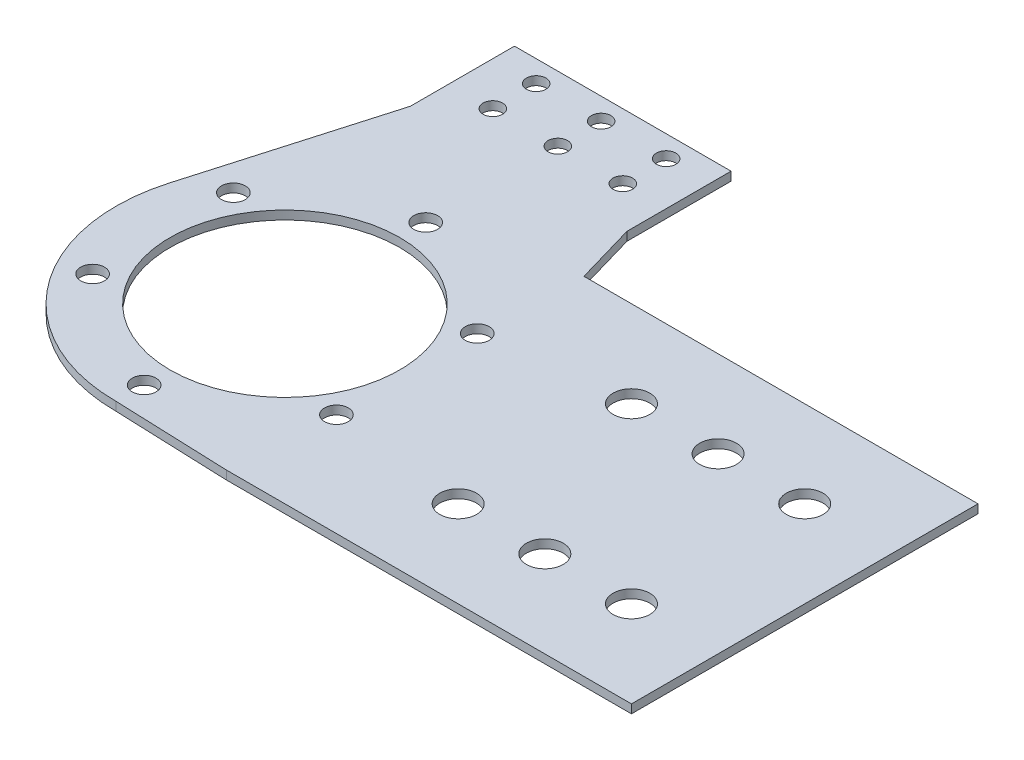
ISO-10303-21;
HEADER;
FILE_DESCRIPTION(('STEP AP214'),'2;1');
FILE_NAME('part.step','',(''),(''),'','','');
FILE_SCHEMA(('AUTOMOTIVE_DESIGN { 1 0 10303 214 1 1 1 1 }'));
ENDSEC;
DATA;
#1=APPLICATION_CONTEXT('core data for automotive mechanical design processes');
#2=APPLICATION_PROTOCOL_DEFINITION('international standard','automotive_design',2000,#1);
#3=PRODUCT_CONTEXT('',#1,'mechanical');
#4=PRODUCT('Part','Part','',(#3));
#5=PRODUCT_RELATED_PRODUCT_CATEGORY('part','',(#4));
#6=PRODUCT_DEFINITION_FORMATION('','',#4);
#7=PRODUCT_DEFINITION_CONTEXT('part definition',#1,'design');
#8=PRODUCT_DEFINITION('design','',#6,#7);
#9=PRODUCT_DEFINITION_SHAPE('','',#8);
#10=(LENGTH_UNIT() NAMED_UNIT(*) SI_UNIT(.MILLI.,.METRE.));
#11=(NAMED_UNIT(*) PLANE_ANGLE_UNIT() SI_UNIT($,.RADIAN.));
#12=(NAMED_UNIT(*) SI_UNIT($,.STERADIAN.) SOLID_ANGLE_UNIT());
#13=UNCERTAINTY_MEASURE_WITH_UNIT(LENGTH_MEASURE(1.E-05),#10,'distance_accuracy_value','');
#14=(GEOMETRIC_REPRESENTATION_CONTEXT(3) GLOBAL_UNCERTAINTY_ASSIGNED_CONTEXT((#13)) GLOBAL_UNIT_ASSIGNED_CONTEXT((#10,
#11,#12)) REPRESENTATION_CONTEXT('',''));
#15=CARTESIAN_POINT('',(0.,0.,0.));
#16=DIRECTION('',(0.,0.,1.));
#17=DIRECTION('',(1.,0.,0.));
#18=AXIS2_PLACEMENT_3D('',#15,#16,#17);
#19=CARTESIAN_POINT('',(100.,-1.,20.));
#20=DIRECTION('',(0.,1.,0.));
#21=DIRECTION('',(0.,0.,1.));
#22=AXIS2_PLACEMENT_3D('',#19,#20,#21);
#23=CYLINDRICAL_SURFACE('',#22,4.25);
#24=CARTESIAN_POINT('',(100.,1.,20.));
#25=DIRECTION('',(0.,1.,0.));
#26=DIRECTION('',(0.,0.,1.));
#27=AXIS2_PLACEMENT_3D('',#24,#25,#26);
#28=CIRCLE('',#27,4.25);
#29=CARTESIAN_POINT('',(100.,1.,24.25));
#30=VERTEX_POINT('',#29);
#31=EDGE_CURVE('E40',#30,#30,#28,.T.);
#32=ORIENTED_EDGE('',*,*,#31,.T.);
#33=EDGE_LOOP('',(#32));
#34=FACE_BOUND('',#33,.T.);
#35=CARTESIAN_POINT('',(100.,-1.,20.));
#36=DIRECTION('',(0.,1.,0.));
#37=DIRECTION('',(0.,0.,1.));
#38=AXIS2_PLACEMENT_3D('',#35,#36,#37);
#39=CIRCLE('',#38,4.25);
#40=CARTESIAN_POINT('',(100.,-1.,24.25));
#41=VERTEX_POINT('',#40);
#42=EDGE_CURVE('E11',#41,#41,#39,.T.);
#43=ORIENTED_EDGE('',*,*,#42,.F.);
#44=EDGE_LOOP('',(#43));
#45=FACE_BOUND('',#44,.T.);
#46=ADVANCED_FACE('F33',(#34,#45),#23,.F.);
#47=CARTESIAN_POINT('',(100.,-1.,-20.));
#48=DIRECTION('',(0.,1.,0.));
#49=DIRECTION('',(0.,0.,1.));
#50=AXIS2_PLACEMENT_3D('',#47,#48,#49);
#51=CYLINDRICAL_SURFACE('',#50,4.25);
#52=CARTESIAN_POINT('',(100.,1.,-20.));
#53=DIRECTION('',(0.,1.,0.));
#54=DIRECTION('',(0.,0.,1.));
#55=AXIS2_PLACEMENT_3D('',#52,#53,#54);
#56=CIRCLE('',#55,4.25);
#57=CARTESIAN_POINT('',(100.,1.,-15.75));
#58=VERTEX_POINT('',#57);
#59=EDGE_CURVE('E210',#58,#58,#56,.T.);
#60=ORIENTED_EDGE('',*,*,#59,.T.);
#61=EDGE_LOOP('',(#60));
#62=FACE_BOUND('',#61,.T.);
#63=CARTESIAN_POINT('',(100.,-1.,-20.));
#64=DIRECTION('',(0.,1.,0.));
#65=DIRECTION('',(0.,0.,1.));
#66=AXIS2_PLACEMENT_3D('',#63,#64,#65);
#67=CIRCLE('',#66,4.25);
#68=CARTESIAN_POINT('',(100.,-1.,-15.75));
#69=VERTEX_POINT('',#68);
#70=EDGE_CURVE('E213',#69,#69,#67,.T.);
#71=ORIENTED_EDGE('',*,*,#70,.F.);
#72=EDGE_LOOP('',(#71));
#73=FACE_BOUND('',#72,.T.);
#74=ADVANCED_FACE('F239',(#62,#73),#51,.F.);
#75=CARTESIAN_POINT('',(15.,-1.,-63.));
#76=DIRECTION('',(0.,1.,0.));
#77=DIRECTION('',(0.,0.,1.));
#78=AXIS2_PLACEMENT_3D('',#75,#76,#77);
#79=CYLINDRICAL_SURFACE('',#78,2.25);
#80=CARTESIAN_POINT('',(15.,1.,-63.));
#81=DIRECTION('',(0.,1.,0.));
#82=DIRECTION('',(0.,0.,1.));
#83=AXIS2_PLACEMENT_3D('',#80,#81,#82);
#84=CIRCLE('',#83,2.25);
#85=CARTESIAN_POINT('',(15.,1.,-60.75));
#86=VERTEX_POINT('',#85);
#87=EDGE_CURVE('E204',#86,#86,#84,.T.);
#88=ORIENTED_EDGE('',*,*,#87,.T.);
#89=EDGE_LOOP('',(#88));
#90=FACE_BOUND('',#89,.T.);
#91=CARTESIAN_POINT('',(15.,-1.,-63.));
#92=DIRECTION('',(0.,1.,0.));
#93=DIRECTION('',(0.,0.,1.));
#94=AXIS2_PLACEMENT_3D('',#91,#92,#93);
#95=CIRCLE('',#94,2.25);
#96=CARTESIAN_POINT('',(15.,-1.,-60.75));
#97=VERTEX_POINT('',#96);
#98=EDGE_CURVE('E207',#97,#97,#95,.T.);
#99=ORIENTED_EDGE('',*,*,#98,.F.);
#100=EDGE_LOOP('',(#99));
#101=FACE_BOUND('',#100,.T.);
#102=ADVANCED_FACE('F243',(#90,#101),#79,.F.);
#103=CARTESIAN_POINT('',(0.,-1.,-63.));
#104=DIRECTION('',(0.,1.,0.));
#105=DIRECTION('',(0.,0.,1.));
#106=AXIS2_PLACEMENT_3D('',#103,#104,#105);
#107=CYLINDRICAL_SURFACE('',#106,2.25);
#108=CARTESIAN_POINT('',(0.,1.,-63.));
#109=DIRECTION('',(0.,1.,0.));
#110=DIRECTION('',(0.,0.,1.));
#111=AXIS2_PLACEMENT_3D('',#108,#109,#110);
#112=CIRCLE('',#111,2.25);
#113=CARTESIAN_POINT('',(0.,1.,-60.75));
#114=VERTEX_POINT('',#113);
#115=EDGE_CURVE('E198',#114,#114,#112,.T.);
#116=ORIENTED_EDGE('',*,*,#115,.T.);
#117=EDGE_LOOP('',(#116));
#118=FACE_BOUND('',#117,.T.);
#119=CARTESIAN_POINT('',(0.,-1.,-63.));
#120=DIRECTION('',(0.,1.,0.));
#121=DIRECTION('',(0.,0.,1.));
#122=AXIS2_PLACEMENT_3D('',#119,#120,#121);
#123=CIRCLE('',#122,2.25);
#124=CARTESIAN_POINT('',(0.,-1.,-60.75));
#125=VERTEX_POINT('',#124);
#126=EDGE_CURVE('E201',#125,#125,#123,.T.);
#127=ORIENTED_EDGE('',*,*,#126,.F.);
#128=EDGE_LOOP('',(#127));
#129=FACE_BOUND('',#128,.T.);
#130=ADVANCED_FACE('F248',(#118,#129),#107,.F.);
#131=CARTESIAN_POINT('',(0.,1.,0.));
#132=DIRECTION('',(0.,-1.,0.));
#133=DIRECTION('',(0.,0.,-1.));
#134=AXIS2_PLACEMENT_3D('',#131,#132,#133);
#135=CYLINDRICAL_SURFACE('',#134,39.);
#136=DIRECTION('',(0.,-1.,0.));
#137=VECTOR('',#136,1.);
#138=CARTESIAN_POINT('',(0.,1.,39.));
#139=LINE('',#138,#137);
#140=CARTESIAN_POINT('',(0.,1.,39.));
#141=VERTEX_POINT('',#140);
#142=CARTESIAN_POINT('',(0.,-1.,39.));
#143=VERTEX_POINT('',#142);
#144=EDGE_CURVE('E47',#141,#143,#139,.T.);
#145=ORIENTED_EDGE('',*,*,#144,.F.);
#146=CARTESIAN_POINT('',(0.,1.,0.));
#147=DIRECTION('',(0.,1.,0.));
#148=DIRECTION('',(0.,0.,1.));
#149=AXIS2_PLACEMENT_3D('',#146,#147,#148);
#150=CIRCLE('',#149,39.);
#151=CARTESIAN_POINT('',(-37.4668243148068,1.,-10.8276071116106));
#152=VERTEX_POINT('',#151);
#153=EDGE_CURVE('E116',#152,#141,#150,.T.);
#154=ORIENTED_EDGE('',*,*,#153,.F.);
#155=DIRECTION('',(0.,-1.,0.));
#156=VECTOR('',#155,1.);
#157=CARTESIAN_POINT('',(-37.4668243148068,1.,-10.8276071116107));
#158=LINE('',#157,#156);
#159=CARTESIAN_POINT('',(-37.4668243148068,-1.,-10.8276071116106));
#160=VERTEX_POINT('',#159);
#161=EDGE_CURVE('E161',#152,#160,#158,.T.);
#162=ORIENTED_EDGE('',*,*,#161,.T.);
#163=CARTESIAN_POINT('',(0.,-1.,0.));
#164=DIRECTION('',(0.,1.,0.));
#165=DIRECTION('',(0.,0.,1.));
#166=AXIS2_PLACEMENT_3D('',#163,#164,#165);
#167=CIRCLE('',#166,39.);
#168=EDGE_CURVE('E52',#160,#143,#167,.T.);
#169=ORIENTED_EDGE('',*,*,#168,.T.);
#170=EDGE_LOOP('',(#145,#154,#162,#169));
#171=FACE_BOUND('',#170,.T.);
#172=ADVANCED_FACE('F255',(#171),#135,.T.);
#173=CARTESIAN_POINT('',(25.,1.,-53.9666295470958));
#174=DIRECTION('',(-0.960687814000371,0.,0.277630913320526));
#175=DIRECTION('',(0.277630913320526,0.,0.960687814000371));
#176=AXIS2_PLACEMENT_3D('',#173,#174,#175);
#177=PLANE('',#176);
#178=DIRECTION('',(0.,1.,0.));
#179=VECTOR('',#178,1.);
#180=CARTESIAN_POINT('',(29.0362415975937,1.,-39.9999999999999));
#181=LINE('',#180,#179);
#182=CARTESIAN_POINT('',(29.0362415975937,-1.,-39.9999999999999));
#183=VERTEX_POINT('',#182);
#184=CARTESIAN_POINT('',(29.0362415975937,1.,-40.));
#185=VERTEX_POINT('',#184);
#186=EDGE_CURVE('E194',#183,#185,#181,.T.);
#187=ORIENTED_EDGE('',*,*,#186,.F.);
#188=DIRECTION('',(-0.277630913320526,0.,-0.96068781400037));
#189=VECTOR('',#188,1.);
#190=CARTESIAN_POINT('',(25.,-1.,-53.9666295470958));
#191=LINE('',#190,#189);
#192=CARTESIAN_POINT('',(25.,-1.,-53.9666295470958));
#193=VERTEX_POINT('',#192);
#194=EDGE_CURVE('E151',#183,#193,#191,.T.);
#195=ORIENTED_EDGE('',*,*,#194,.T.);
#196=DIRECTION('',(0.,-1.,0.));
#197=VECTOR('',#196,1.);
#198=CARTESIAN_POINT('',(25.,1.,-53.9666295470958));
#199=LINE('',#198,#197);
#200=CARTESIAN_POINT('',(25.,1.,-53.9666295470958));
#201=VERTEX_POINT('',#200);
#202=EDGE_CURVE('E154',#201,#193,#199,.T.);
#203=ORIENTED_EDGE('',*,*,#202,.F.);
#204=DIRECTION('',(-0.277630913320526,0.,-0.96068781400037));
#205=VECTOR('',#204,1.);
#206=CARTESIAN_POINT('',(25.,1.,-53.9666295470958));
#207=LINE('',#206,#205);
#208=EDGE_CURVE('E152',#185,#201,#207,.T.);
#209=ORIENTED_EDGE('',*,*,#208,.F.);
#210=EDGE_LOOP('',(#187,#195,#203,#209));
#211=FACE_BOUND('',#210,.T.);
#212=ADVANCED_FACE('F258',(#211),#177,.F.);
#213=CARTESIAN_POINT('',(25.,1.,-78.));
#214=DIRECTION('',(-1.,0.,0.));
#215=DIRECTION('',(0.,0.,1.));
#216=AXIS2_PLACEMENT_3D('',#213,#214,#215);
#217=PLANE('',#216);
#218=ORIENTED_EDGE('',*,*,#202,.T.);
#219=DIRECTION('',(0.,0.,-1.));
#220=VECTOR('',#219,1.);
#221=CARTESIAN_POINT('',(25.,-1.,-78.));
#222=LINE('',#221,#220);
#223=CARTESIAN_POINT('',(25.,-1.,-78.));
#224=VERTEX_POINT('',#223);
#225=EDGE_CURVE('E168',#193,#224,#222,.T.);
#226=ORIENTED_EDGE('',*,*,#225,.T.);
#227=DIRECTION('',(0.,-1.,0.));
#228=VECTOR('',#227,1.);
#229=CARTESIAN_POINT('',(25.,1.,-78.));
#230=LINE('',#229,#228);
#231=CARTESIAN_POINT('',(25.,1.,-78.));
#232=VERTEX_POINT('',#231);
#233=EDGE_CURVE('E184',#232,#224,#230,.T.);
#234=ORIENTED_EDGE('',*,*,#233,.F.);
#235=DIRECTION('',(0.,0.,-1.));
#236=VECTOR('',#235,1.);
#237=CARTESIAN_POINT('',(25.,1.,-78.));
#238=LINE('',#237,#236);
#239=EDGE_CURVE('E169',#201,#232,#238,.T.);
#240=ORIENTED_EDGE('',*,*,#239,.F.);
#241=EDGE_LOOP('',(#218,#226,#234,#240));
#242=FACE_BOUND('',#241,.T.);
#243=ADVANCED_FACE('F232',(#242),#217,.F.);
#244=CARTESIAN_POINT('',(-25.,1.,-78.));
#245=DIRECTION('',(1.,0.,0.));
#246=DIRECTION('',(0.,0.,-1.));
#247=AXIS2_PLACEMENT_3D('',#244,#245,#246);
#248=PLANE('',#247);
#249=DIRECTION('',(0.,-1.,0.));
#250=VECTOR('',#249,1.);
#251=CARTESIAN_POINT('',(-25.,1.,-53.9666295470958));
#252=LINE('',#251,#250);
#253=CARTESIAN_POINT('',(-25.,1.,-53.9666295470958));
#254=VERTEX_POINT('',#253);
#255=CARTESIAN_POINT('',(-25.,-1.,-53.9666295470958));
#256=VERTEX_POINT('',#255);
#257=EDGE_CURVE('E165',#254,#256,#252,.T.);
#258=ORIENTED_EDGE('',*,*,#257,.F.);
#259=DIRECTION('',(0.,0.,1.));
#260=VECTOR('',#259,1.);
#261=CARTESIAN_POINT('',(-25.,1.,-78.));
#262=LINE('',#261,#260);
#263=CARTESIAN_POINT('',(-25.,1.,-78.));
#264=VERTEX_POINT('',#263);
#265=EDGE_CURVE('E174',#264,#254,#262,.T.);
#266=ORIENTED_EDGE('',*,*,#265,.F.);
#267=DIRECTION('',(0.,-1.,0.));
#268=VECTOR('',#267,1.);
#269=CARTESIAN_POINT('',(-25.,1.,-78.));
#270=LINE('',#269,#268);
#271=CARTESIAN_POINT('',(-25.,-1.,-78.));
#272=VERTEX_POINT('',#271);
#273=EDGE_CURVE('E177',#264,#272,#270,.T.);
#274=ORIENTED_EDGE('',*,*,#273,.T.);
#275=DIRECTION('',(0.,0.,1.));
#276=VECTOR('',#275,1.);
#277=CARTESIAN_POINT('',(-25.,-1.,-78.));
#278=LINE('',#277,#276);
#279=EDGE_CURVE('E172',#272,#256,#278,.T.);
#280=ORIENTED_EDGE('',*,*,#279,.T.);
#281=EDGE_LOOP('',(#258,#266,#274,#280));
#282=FACE_BOUND('',#281,.T.);
#283=ADVANCED_FACE('F222',(#282),#248,.F.);
#284=CARTESIAN_POINT('',(0.,1.,0.));
#285=DIRECTION('',(0.,1.,0.));
#286=DIRECTION('',(0.,0.,1.));
#287=AXIS2_PLACEMENT_3D('',#284,#285,#286);
#288=PLANE('',#287);
#289=CARTESIAN_POINT('',(80.,1.,20.));
#290=DIRECTION('',(0.,1.,0.));
#291=DIRECTION('',(0.,0.,1.));
#292=AXIS2_PLACEMENT_3D('',#289,#290,#291);
#293=CIRCLE('',#292,4.25);
#294=CARTESIAN_POINT('',(80.,1.,24.25));
#295=VERTEX_POINT('',#294);
#296=EDGE_CURVE('E570',#295,#295,#293,.T.);
#297=ORIENTED_EDGE('',*,*,#296,.F.);
#298=EDGE_LOOP('',(#297));
#299=FACE_BOUND('',#298,.T.);
#300=CARTESIAN_POINT('',(80.,1.,-20.));
#301=DIRECTION('',(0.,1.,0.));
#302=DIRECTION('',(0.,0.,1.));
#303=AXIS2_PLACEMENT_3D('',#300,#301,#302);
#304=CIRCLE('',#303,4.25);
#305=CARTESIAN_POINT('',(80.,1.,-15.75));
#306=VERTEX_POINT('',#305);
#307=EDGE_CURVE('E574',#306,#306,#304,.T.);
#308=ORIENTED_EDGE('',*,*,#307,.F.);
#309=EDGE_LOOP('',(#308));
#310=FACE_BOUND('',#309,.T.);
#311=CARTESIAN_POINT('',(60.,1.,-20.));
#312=DIRECTION('',(0.,1.,0.));
#313=DIRECTION('',(0.,0.,1.));
#314=AXIS2_PLACEMENT_3D('',#311,#312,#313);
#315=CIRCLE('',#314,4.25);
#316=CARTESIAN_POINT('',(60.,1.,-15.75));
#317=VERTEX_POINT('',#316);
#318=EDGE_CURVE('E592',#317,#317,#315,.T.);
#319=ORIENTED_EDGE('',*,*,#318,.F.);
#320=EDGE_LOOP('',(#319));
#321=FACE_BOUND('',#320,.T.);
#322=CARTESIAN_POINT('',(60.,1.,20.));
#323=DIRECTION('',(0.,1.,0.));
#324=DIRECTION('',(0.,0.,1.));
#325=AXIS2_PLACEMENT_3D('',#322,#323,#324);
#326=CIRCLE('',#325,4.25);
#327=CARTESIAN_POINT('',(60.,1.,24.25));
#328=VERTEX_POINT('',#327);
#329=EDGE_CURVE('E587',#328,#328,#326,.T.);
#330=ORIENTED_EDGE('',*,*,#329,.F.);
#331=EDGE_LOOP('',(#330));
#332=FACE_BOUND('',#331,.T.);
#333=CARTESIAN_POINT('',(-15.,1.,-73.));
#334=DIRECTION('',(0.,1.,0.));
#335=DIRECTION('',(0.,0.,1.));
#336=AXIS2_PLACEMENT_3D('',#333,#334,#335);
#337=CIRCLE('',#336,2.25);
#338=CARTESIAN_POINT('',(-15.,1.,-70.75));
#339=VERTEX_POINT('',#338);
#340=EDGE_CURVE('E604',#339,#339,#337,.T.);
#341=ORIENTED_EDGE('',*,*,#340,.F.);
#342=EDGE_LOOP('',(#341));
#343=FACE_BOUND('',#342,.T.);
#344=CARTESIAN_POINT('',(-15.,1.,-63.));
#345=DIRECTION('',(0.,1.,0.));
#346=DIRECTION('',(0.,0.,1.));
#347=AXIS2_PLACEMENT_3D('',#344,#345,#346);
#348=CIRCLE('',#347,2.25);
#349=CARTESIAN_POINT('',(-15.,1.,-60.75));
#350=VERTEX_POINT('',#349);
#351=EDGE_CURVE('E599',#350,#350,#348,.T.);
#352=ORIENTED_EDGE('',*,*,#351,.F.);
#353=EDGE_LOOP('',(#352));
#354=FACE_BOUND('',#353,.T.);
#355=CARTESIAN_POINT('',(15.,1.,-73.));
#356=DIRECTION('',(0.,1.,0.));
#357=DIRECTION('',(0.,0.,1.));
#358=AXIS2_PLACEMENT_3D('',#355,#356,#357);
#359=CIRCLE('',#358,2.25);
#360=CARTESIAN_POINT('',(15.,1.,-70.75));
#361=VERTEX_POINT('',#360);
#362=EDGE_CURVE('E607',#361,#361,#359,.T.);
#363=ORIENTED_EDGE('',*,*,#362,.F.);
#364=EDGE_LOOP('',(#363));
#365=FACE_BOUND('',#364,.T.);
#366=CARTESIAN_POINT('',(0.,1.,-73.));
#367=DIRECTION('',(0.,1.,0.));
#368=DIRECTION('',(0.,0.,1.));
#369=AXIS2_PLACEMENT_3D('',#366,#367,#368);
#370=CIRCLE('',#369,2.25);
#371=CARTESIAN_POINT('',(0.,1.,-70.75));
#372=VERTEX_POINT('',#371);
#373=EDGE_CURVE('E616',#372,#372,#370,.T.);
#374=ORIENTED_EDGE('',*,*,#373,.F.);
#375=EDGE_LOOP('',(#374));
#376=FACE_BOUND('',#375,.T.);
#377=CARTESIAN_POINT('',(28.1458256229941,1.,-16.2500000000003));
#378=DIRECTION('',(0.,1.,0.));
#379=DIRECTION('',(-0.866025403784433,0.,0.50000000000001));
#380=AXIS2_PLACEMENT_3D('',#377,#378,#379);
#381=CIRCLE('',#380,2.75);
#382=CARTESIAN_POINT('',(25.7642557625869,1.,-14.8750000000003));
#383=VERTEX_POINT('',#382);
#384=EDGE_CURVE('E619',#383,#383,#381,.T.);
#385=ORIENTED_EDGE('',*,*,#384,.F.);
#386=EDGE_LOOP('',(#385));
#387=FACE_BOUND('',#386,.T.);
#388=CARTESIAN_POINT('',(28.1458256229944,1.,16.2499999999997));
#389=DIRECTION('',(0.,1.,0.));
#390=DIRECTION('',(-0.866025403784443,0.,-0.499999999999992));
#391=AXIS2_PLACEMENT_3D('',#388,#389,#390);
#392=CIRCLE('',#391,2.75);
#393=CARTESIAN_POINT('',(25.7642557625872,1.,14.8749999999998));
#394=VERTEX_POINT('',#393);
#395=EDGE_CURVE('E634',#394,#394,#392,.T.);
#396=ORIENTED_EDGE('',*,*,#395,.F.);
#397=EDGE_LOOP('',(#396));
#398=FACE_BOUND('',#397,.T.);
#399=CARTESIAN_POINT('',(0.,1.,32.5));
#400=DIRECTION('',(0.,1.,0.));
#401=DIRECTION('',(0.,0.,-1.));
#402=AXIS2_PLACEMENT_3D('',#399,#400,#401);
#403=CIRCLE('',#402,2.75);
#404=CARTESIAN_POINT('',(0.,1.,29.75));
#405=VERTEX_POINT('',#404);
#406=EDGE_CURVE('E628',#405,#405,#403,.T.);
#407=ORIENTED_EDGE('',*,*,#406,.F.);
#408=EDGE_LOOP('',(#407));
#409=FACE_BOUND('',#408,.T.);
#410=CARTESIAN_POINT('',(-28.1458256229942,1.,16.2500000000001));
#411=DIRECTION('',(0.,1.,0.));
#412=DIRECTION('',(0.866025403784436,0.,-0.500000000000004));
#413=AXIS2_PLACEMENT_3D('',#410,#411,#412);
#414=CIRCLE('',#413,2.75);
#415=CARTESIAN_POINT('',(-25.764255762587,1.,14.8750000000001));
#416=VERTEX_POINT('',#415);
#417=EDGE_CURVE('E620',#416,#416,#414,.T.);
#418=ORIENTED_EDGE('',*,*,#417,.F.);
#419=EDGE_LOOP('',(#418));
#420=FACE_BOUND('',#419,.T.);
#421=CARTESIAN_POINT('',(-28.1458256229943,1.,-16.2499999999999));
#422=DIRECTION('',(0.,1.,0.));
#423=DIRECTION('',(0.86602540378444,0.,0.499999999999998));
#424=AXIS2_PLACEMENT_3D('',#421,#422,#423);
#425=CIRCLE('',#424,2.75);
#426=CARTESIAN_POINT('',(-25.7642557625871,1.,-14.8749999999999));
#427=VERTEX_POINT('',#426);
#428=EDGE_CURVE('E627',#427,#427,#425,.T.);
#429=ORIENTED_EDGE('',*,*,#428,.F.);
#430=EDGE_LOOP('',(#429));
#431=FACE_BOUND('',#430,.T.);
#432=CARTESIAN_POINT('',(0.,1.,-32.5));
#433=DIRECTION('',(0.,1.,0.));
#434=DIRECTION('',(0.,0.,1.));
#435=AXIS2_PLACEMENT_3D('',#432,#433,#434);
#436=CIRCLE('',#435,2.75);
#437=CARTESIAN_POINT('',(0.,1.,-29.75));
#438=VERTEX_POINT('',#437);
#439=EDGE_CURVE('E649',#438,#438,#436,.T.);
#440=ORIENTED_EDGE('',*,*,#439,.F.);
#441=EDGE_LOOP('',(#440));
#442=FACE_BOUND('',#441,.T.);
#443=DIRECTION('',(-1.,0.,0.));
#444=VECTOR('',#443,1.);
#445=CARTESIAN_POINT('',(120.,1.,-40.));
#446=LINE('',#445,#444);
#447=CARTESIAN_POINT('',(120.,1.,-40.));
#448=VERTEX_POINT('',#447);
#449=EDGE_CURVE('E133',#448,#185,#446,.T.);
#450=ORIENTED_EDGE('',*,*,#449,.T.);
#451=ORIENTED_EDGE('',*,*,#208,.T.);
#452=ORIENTED_EDGE('',*,*,#239,.T.);
#453=DIRECTION('',(-1.,0.,0.));
#454=VECTOR('',#453,1.);
#455=CARTESIAN_POINT('',(-25.,1.,-78.));
#456=LINE('',#455,#454);
#457=EDGE_CURVE('E171',#232,#264,#456,.T.);
#458=ORIENTED_EDGE('',*,*,#457,.T.);
#459=ORIENTED_EDGE('',*,*,#265,.T.);
#460=DIRECTION('',(-0.277630913320526,0.,0.96068781400037));
#461=VECTOR('',#460,1.);
#462=CARTESIAN_POINT('',(-25.,1.,-53.9666295470958));
#463=LINE('',#462,#461);
#464=EDGE_CURVE('E159',#254,#152,#463,.T.);
#465=ORIENTED_EDGE('',*,*,#464,.T.);
#466=ORIENTED_EDGE('',*,*,#153,.T.);
#467=DIRECTION('',(0.999288762356679,0.,0.0377090099002538));
#468=VECTOR('',#467,1.);
#469=CARTESIAN_POINT('',(26.5,1.,40.));
#470=LINE('',#469,#468);
#471=CARTESIAN_POINT('',(26.5,1.,40.));
#472=VERTEX_POINT('',#471);
#473=EDGE_CURVE('E107',#141,#472,#470,.T.);
#474=ORIENTED_EDGE('',*,*,#473,.T.);
#475=DIRECTION('',(1.,0.,0.));
#476=VECTOR('',#475,1.);
#477=CARTESIAN_POINT('',(120.,1.,40.));
#478=LINE('',#477,#476);
#479=CARTESIAN_POINT('',(120.,1.,40.));
#480=VERTEX_POINT('',#479);
#481=EDGE_CURVE('E113',#472,#480,#478,.T.);
#482=ORIENTED_EDGE('',*,*,#481,.T.);
#483=DIRECTION('',(0.,0.,-1.));
#484=VECTOR('',#483,1.);
#485=CARTESIAN_POINT('',(120.,1.,40.));
#486=LINE('',#485,#484);
#487=EDGE_CURVE('E131',#480,#448,#486,.T.);
#488=ORIENTED_EDGE('',*,*,#487,.T.);
#489=EDGE_LOOP('',(#450,#451,#452,#458,#459,#465,#466,#474,#482,#488));
#490=FACE_BOUND('',#489,.T.);
#491=CARTESIAN_POINT('',(0.,1.,0.));
#492=DIRECTION('',(0.,1.,0.));
#493=DIRECTION('',(0.,0.,1.));
#494=AXIS2_PLACEMENT_3D('',#491,#492,#493);
#495=CIRCLE('',#494,26.5);
#496=CARTESIAN_POINT('',(0.,1.,26.5));
#497=VERTEX_POINT('',#496);
#498=EDGE_CURVE('E188',#497,#497,#495,.T.);
#499=ORIENTED_EDGE('',*,*,#498,.F.);
#500=EDGE_LOOP('',(#499));
#501=FACE_BOUND('',#500,.T.);
#502=ORIENTED_EDGE('',*,*,#115,.F.);
#503=EDGE_LOOP('',(#502));
#504=FACE_BOUND('',#503,.T.);
#505=ORIENTED_EDGE('',*,*,#87,.F.);
#506=EDGE_LOOP('',(#505));
#507=FACE_BOUND('',#506,.T.);
#508=ORIENTED_EDGE('',*,*,#59,.F.);
#509=EDGE_LOOP('',(#508));
#510=FACE_BOUND('',#509,.T.);
#511=ORIENTED_EDGE('',*,*,#31,.F.);
#512=EDGE_LOOP('',(#511));
#513=FACE_BOUND('',#512,.T.);
#514=ADVANCED_FACE('F110',(#299,#310,#321,#332,#343,#354,#365,#376,#387,#398,#409,#420,#431,
#442,#490,#501,#504,#507,#510,#513),#288,.T.);
#515=CARTESIAN_POINT('',(0.,-1.,0.));
#516=DIRECTION('',(0.,1.,0.));
#517=DIRECTION('',(0.,0.,1.));
#518=AXIS2_PLACEMENT_3D('',#515,#516,#517);
#519=PLANE('',#518);
#520=CARTESIAN_POINT('',(80.,-1.,20.));
#521=DIRECTION('',(0.,1.,0.));
#522=DIRECTION('',(0.,0.,1.));
#523=AXIS2_PLACEMENT_3D('',#520,#521,#522);
#524=CIRCLE('',#523,4.25);
#525=CARTESIAN_POINT('',(80.,-1.,24.25));
#526=VERTEX_POINT('',#525);
#527=EDGE_CURVE('E573',#526,#526,#524,.T.);
#528=ORIENTED_EDGE('',*,*,#527,.T.);
#529=EDGE_LOOP('',(#528));
#530=FACE_BOUND('',#529,.T.);
#531=CARTESIAN_POINT('',(80.,-1.,-20.));
#532=DIRECTION('',(0.,1.,0.));
#533=DIRECTION('',(0.,0.,1.));
#534=AXIS2_PLACEMENT_3D('',#531,#532,#533);
#535=CIRCLE('',#534,4.25);
#536=CARTESIAN_POINT('',(80.,-1.,-15.75));
#537=VERTEX_POINT('',#536);
#538=EDGE_CURVE('E577',#537,#537,#535,.T.);
#539=ORIENTED_EDGE('',*,*,#538,.T.);
#540=EDGE_LOOP('',(#539));
#541=FACE_BOUND('',#540,.T.);
#542=CARTESIAN_POINT('',(60.,-1.,-20.));
#543=DIRECTION('',(0.,1.,0.));
#544=DIRECTION('',(0.,0.,1.));
#545=AXIS2_PLACEMENT_3D('',#542,#543,#544);
#546=CIRCLE('',#545,4.25);
#547=CARTESIAN_POINT('',(60.,-1.,-15.75));
#548=VERTEX_POINT('',#547);
#549=EDGE_CURVE('E584',#548,#548,#546,.T.);
#550=ORIENTED_EDGE('',*,*,#549,.T.);
#551=EDGE_LOOP('',(#550));
#552=FACE_BOUND('',#551,.T.);
#553=CARTESIAN_POINT('',(60.,-1.,20.));
#554=DIRECTION('',(0.,1.,0.));
#555=DIRECTION('',(0.,0.,1.));
#556=AXIS2_PLACEMENT_3D('',#553,#554,#555);
#557=CIRCLE('',#556,4.25);
#558=CARTESIAN_POINT('',(60.,-1.,24.25));
#559=VERTEX_POINT('',#558);
#560=EDGE_CURVE('E583',#559,#559,#557,.T.);
#561=ORIENTED_EDGE('',*,*,#560,.T.);
#562=EDGE_LOOP('',(#561));
#563=FACE_BOUND('',#562,.T.);
#564=CARTESIAN_POINT('',(-15.,-1.,-73.));
#565=DIRECTION('',(0.,1.,0.));
#566=DIRECTION('',(0.,0.,1.));
#567=AXIS2_PLACEMENT_3D('',#564,#565,#566);
#568=CIRCLE('',#567,2.25);
#569=CARTESIAN_POINT('',(-15.,-1.,-70.75));
#570=VERTEX_POINT('',#569);
#571=EDGE_CURVE('E596',#570,#570,#568,.T.);
#572=ORIENTED_EDGE('',*,*,#571,.T.);
#573=EDGE_LOOP('',(#572));
#574=FACE_BOUND('',#573,.T.);
#575=CARTESIAN_POINT('',(-15.,-1.,-63.));
#576=DIRECTION('',(0.,1.,0.));
#577=DIRECTION('',(0.,0.,1.));
#578=AXIS2_PLACEMENT_3D('',#575,#576,#577);
#579=CIRCLE('',#578,2.25);
#580=CARTESIAN_POINT('',(-15.,-1.,-60.75));
#581=VERTEX_POINT('',#580);
#582=EDGE_CURVE('E595',#581,#581,#579,.T.);
#583=ORIENTED_EDGE('',*,*,#582,.T.);
#584=EDGE_LOOP('',(#583));
#585=FACE_BOUND('',#584,.T.);
#586=CARTESIAN_POINT('',(15.,-1.,-73.));
#587=DIRECTION('',(0.,1.,0.));
#588=DIRECTION('',(0.,0.,1.));
#589=AXIS2_PLACEMENT_3D('',#586,#587,#588);
#590=CIRCLE('',#589,2.25);
#591=CARTESIAN_POINT('',(15.,-1.,-70.75));
#592=VERTEX_POINT('',#591);
#593=EDGE_CURVE('E610',#592,#592,#590,.T.);
#594=ORIENTED_EDGE('',*,*,#593,.T.);
#595=EDGE_LOOP('',(#594));
#596=FACE_BOUND('',#595,.T.);
#597=CARTESIAN_POINT('',(0.,-1.,-73.));
#598=DIRECTION('',(0.,1.,0.));
#599=DIRECTION('',(0.,0.,1.));
#600=AXIS2_PLACEMENT_3D('',#597,#598,#599);
#601=CIRCLE('',#600,2.25);
#602=CARTESIAN_POINT('',(0.,-1.,-70.75));
#603=VERTEX_POINT('',#602);
#604=EDGE_CURVE('E613',#603,#603,#601,.T.);
#605=ORIENTED_EDGE('',*,*,#604,.T.);
#606=EDGE_LOOP('',(#605));
#607=FACE_BOUND('',#606,.T.);
#608=CARTESIAN_POINT('',(28.1458256229941,-1.,-16.2500000000003));
#609=DIRECTION('',(0.,1.,0.));
#610=DIRECTION('',(-0.866025403784433,0.,0.50000000000001));
#611=AXIS2_PLACEMENT_3D('',#608,#609,#610);
#612=CIRCLE('',#611,2.75);
#613=CARTESIAN_POINT('',(25.7642557625869,-1.,-14.8750000000003));
#614=VERTEX_POINT('',#613);
#615=EDGE_CURVE('E637',#614,#614,#612,.T.);
#616=ORIENTED_EDGE('',*,*,#615,.T.);
#617=EDGE_LOOP('',(#616));
#618=FACE_BOUND('',#617,.T.);
#619=CARTESIAN_POINT('',(28.1458256229944,-1.,16.2499999999997));
#620=DIRECTION('',(0.,1.,0.));
#621=DIRECTION('',(-0.866025403784443,0.,-0.499999999999992));
#622=AXIS2_PLACEMENT_3D('',#619,#620,#621);
#623=CIRCLE('',#622,2.75);
#624=CARTESIAN_POINT('',(25.7642557625872,-1.,14.8749999999998));
#625=VERTEX_POINT('',#624);
#626=EDGE_CURVE('E631',#625,#625,#623,.T.);
#627=ORIENTED_EDGE('',*,*,#626,.T.);
#628=EDGE_LOOP('',(#627));
#629=FACE_BOUND('',#628,.T.);
#630=CARTESIAN_POINT('',(0.,-1.,32.5));
#631=DIRECTION('',(0.,1.,0.));
#632=DIRECTION('',(0.,0.,-1.));
#633=AXIS2_PLACEMENT_3D('',#630,#631,#632);
#634=CIRCLE('',#633,2.75);
#635=CARTESIAN_POINT('',(0.,-1.,29.75));
#636=VERTEX_POINT('',#635);
#637=EDGE_CURVE('E624',#636,#636,#634,.T.);
#638=ORIENTED_EDGE('',*,*,#637,.T.);
#639=EDGE_LOOP('',(#638));
#640=FACE_BOUND('',#639,.T.);
#641=CARTESIAN_POINT('',(-28.1458256229942,-1.,16.2500000000001));
#642=DIRECTION('',(0.,1.,0.));
#643=DIRECTION('',(0.866025403784436,0.,-0.500000000000004));
#644=AXIS2_PLACEMENT_3D('',#641,#642,#643);
#645=CIRCLE('',#644,2.75);
#646=CARTESIAN_POINT('',(-25.764255762587,-1.,14.8750000000001));
#647=VERTEX_POINT('',#646);
#648=EDGE_CURVE('E623',#647,#647,#645,.T.);
#649=ORIENTED_EDGE('',*,*,#648,.T.);
#650=EDGE_LOOP('',(#649));
#651=FACE_BOUND('',#650,.T.);
#652=CARTESIAN_POINT('',(-28.1458256229943,-1.,-16.2499999999999));
#653=DIRECTION('',(0.,1.,0.));
#654=DIRECTION('',(0.86602540378444,0.,0.499999999999998));
#655=AXIS2_PLACEMENT_3D('',#652,#653,#654);
#656=CIRCLE('',#655,2.75);
#657=CARTESIAN_POINT('',(-25.7642557625871,-1.,-14.8749999999999));
#658=VERTEX_POINT('',#657);
#659=EDGE_CURVE('E646',#658,#658,#656,.T.);
#660=ORIENTED_EDGE('',*,*,#659,.T.);
#661=EDGE_LOOP('',(#660));
#662=FACE_BOUND('',#661,.T.);
#663=CARTESIAN_POINT('',(0.,-1.,-32.5));
#664=DIRECTION('',(0.,1.,0.));
#665=DIRECTION('',(0.,0.,1.));
#666=AXIS2_PLACEMENT_3D('',#663,#664,#665);
#667=CIRCLE('',#666,2.75);
#668=CARTESIAN_POINT('',(0.,-1.,-29.75));
#669=VERTEX_POINT('',#668);
#670=EDGE_CURVE('E141',#669,#669,#667,.T.);
#671=ORIENTED_EDGE('',*,*,#670,.T.);
#672=EDGE_LOOP('',(#671));
#673=FACE_BOUND('',#672,.T.);
#674=ORIENTED_EDGE('',*,*,#194,.F.);
#675=DIRECTION('',(-1.,0.,0.));
#676=VECTOR('',#675,1.);
#677=CARTESIAN_POINT('',(120.,-1.,-40.));
#678=LINE('',#677,#676);
#679=CARTESIAN_POINT('',(120.,-1.,-40.));
#680=VERTEX_POINT('',#679);
#681=EDGE_CURVE('E118',#680,#183,#678,.T.);
#682=ORIENTED_EDGE('',*,*,#681,.F.);
#683=DIRECTION('',(0.,0.,-1.));
#684=VECTOR('',#683,1.);
#685=CARTESIAN_POINT('',(120.,-1.,40.));
#686=LINE('',#685,#684);
#687=CARTESIAN_POINT('',(120.,-1.,40.));
#688=VERTEX_POINT('',#687);
#689=EDGE_CURVE('E143',#688,#680,#686,.T.);
#690=ORIENTED_EDGE('',*,*,#689,.F.);
#691=DIRECTION('',(1.,0.,0.));
#692=VECTOR('',#691,1.);
#693=CARTESIAN_POINT('',(120.,-1.,40.));
#694=LINE('',#693,#692);
#695=CARTESIAN_POINT('',(26.5,-1.,40.));
#696=VERTEX_POINT('',#695);
#697=EDGE_CURVE('E140',#696,#688,#694,.T.);
#698=ORIENTED_EDGE('',*,*,#697,.F.);
#699=DIRECTION('',(0.999288762356679,0.,0.0377090099002538));
#700=VECTOR('',#699,1.);
#701=CARTESIAN_POINT('',(26.5,-1.,40.));
#702=LINE('',#701,#700);
#703=EDGE_CURVE('E123',#143,#696,#702,.T.);
#704=ORIENTED_EDGE('',*,*,#703,.F.);
#705=ORIENTED_EDGE('',*,*,#168,.F.);
#706=DIRECTION('',(-0.277630913320526,0.,0.96068781400037));
#707=VECTOR('',#706,1.);
#708=CARTESIAN_POINT('',(-25.,-1.,-53.9666295470958));
#709=LINE('',#708,#707);
#710=EDGE_CURVE('E158',#256,#160,#709,.T.);
#711=ORIENTED_EDGE('',*,*,#710,.F.);
#712=ORIENTED_EDGE('',*,*,#279,.F.);
#713=DIRECTION('',(-1.,0.,0.));
#714=VECTOR('',#713,1.);
#715=CARTESIAN_POINT('',(-25.,-1.,-78.));
#716=LINE('',#715,#714);
#717=EDGE_CURVE('E179',#224,#272,#716,.T.);
#718=ORIENTED_EDGE('',*,*,#717,.F.);
#719=ORIENTED_EDGE('',*,*,#225,.F.);
#720=EDGE_LOOP('',(#674,#682,#690,#698,#704,#705,#711,#712,#718,#719));
#721=FACE_BOUND('',#720,.T.);
#722=CARTESIAN_POINT('',(0.,-1.,0.));
#723=DIRECTION('',(0.,1.,0.));
#724=DIRECTION('',(0.,0.,1.));
#725=AXIS2_PLACEMENT_3D('',#722,#723,#724);
#726=CIRCLE('',#725,26.5);
#727=CARTESIAN_POINT('',(0.,-1.,26.5));
#728=VERTEX_POINT('',#727);
#729=EDGE_CURVE('E187',#728,#728,#726,.T.);
#730=ORIENTED_EDGE('',*,*,#729,.T.);
#731=EDGE_LOOP('',(#730));
#732=FACE_BOUND('',#731,.T.);
#733=ORIENTED_EDGE('',*,*,#126,.T.);
#734=EDGE_LOOP('',(#733));
#735=FACE_BOUND('',#734,.T.);
#736=ORIENTED_EDGE('',*,*,#98,.T.);
#737=EDGE_LOOP('',(#736));
#738=FACE_BOUND('',#737,.T.);
#739=ORIENTED_EDGE('',*,*,#70,.T.);
#740=EDGE_LOOP('',(#739));
#741=FACE_BOUND('',#740,.T.);
#742=ORIENTED_EDGE('',*,*,#42,.T.);
#743=EDGE_LOOP('',(#742));
#744=FACE_BOUND('',#743,.T.);
#745=ADVANCED_FACE('F221',(#530,#541,#552,#563,#574,#585,#596,#607,#618,#629,#640,#651,#662,
#673,#721,#732,#735,#738,#741,#744),#519,.F.);
#746=CARTESIAN_POINT('',(0.,1.,0.));
#747=DIRECTION('',(0.,-1.,0.));
#748=DIRECTION('',(0.,0.,-1.));
#749=AXIS2_PLACEMENT_3D('',#746,#747,#748);
#750=CYLINDRICAL_SURFACE('',#749,26.5);
#751=ORIENTED_EDGE('',*,*,#729,.F.);
#752=EDGE_LOOP('',(#751));
#753=FACE_BOUND('',#752,.T.);
#754=ORIENTED_EDGE('',*,*,#498,.T.);
#755=EDGE_LOOP('',(#754));
#756=FACE_BOUND('',#755,.T.);
#757=ADVANCED_FACE('F229',(#753,#756),#750,.F.);
#758=CARTESIAN_POINT('',(-25.,1.,-78.));
#759=DIRECTION('',(0.,0.,1.));
#760=DIRECTION('',(1.,0.,0.));
#761=AXIS2_PLACEMENT_3D('',#758,#759,#760);
#762=PLANE('',#761);
#763=ORIENTED_EDGE('',*,*,#717,.T.);
#764=ORIENTED_EDGE('',*,*,#273,.F.);
#765=ORIENTED_EDGE('',*,*,#457,.F.);
#766=ORIENTED_EDGE('',*,*,#233,.T.);
#767=EDGE_LOOP('',(#763,#764,#765,#766));
#768=FACE_BOUND('',#767,.T.);
#769=ADVANCED_FACE('F276',(#768),#762,.F.);
#770=CARTESIAN_POINT('',(-25.,1.,-53.9666295470958));
#771=DIRECTION('',(0.960687814000371,0.,0.277630913320526));
#772=DIRECTION('',(0.277630913320526,0.,-0.960687814000371));
#773=AXIS2_PLACEMENT_3D('',#770,#771,#772);
#774=PLANE('',#773);
#775=ORIENTED_EDGE('',*,*,#710,.T.);
#776=ORIENTED_EDGE('',*,*,#161,.F.);
#777=ORIENTED_EDGE('',*,*,#464,.F.);
#778=ORIENTED_EDGE('',*,*,#257,.T.);
#779=EDGE_LOOP('',(#775,#776,#777,#778));
#780=FACE_BOUND('',#779,.T.);
#781=ADVANCED_FACE('F273',(#780),#774,.F.);
#782=CARTESIAN_POINT('',(120.,1.,-40.));
#783=DIRECTION('',(0.,0.,1.));
#784=DIRECTION('',(1.,0.,0.));
#785=AXIS2_PLACEMENT_3D('',#782,#783,#784);
#786=PLANE('',#785);
#787=ORIENTED_EDGE('',*,*,#681,.T.);
#788=ORIENTED_EDGE('',*,*,#186,.T.);
#789=ORIENTED_EDGE('',*,*,#449,.F.);
#790=DIRECTION('',(0.,-1.,0.));
#791=VECTOR('',#790,1.);
#792=CARTESIAN_POINT('',(120.,1.,-40.));
#793=LINE('',#792,#791);
#794=EDGE_CURVE('E138',#448,#680,#793,.T.);
#795=ORIENTED_EDGE('',*,*,#794,.T.);
#796=EDGE_LOOP('',(#787,#788,#789,#795));
#797=FACE_BOUND('',#796,.T.);
#798=ADVANCED_FACE('F275',(#797),#786,.F.);
#799=CARTESIAN_POINT('',(26.5,1.,40.));
#800=DIRECTION('',(0.0377090099002538,0.,-0.999288762356679));
#801=DIRECTION('',(-0.999288762356679,0.,-0.0377090099002538));
#802=AXIS2_PLACEMENT_3D('',#799,#800,#801);
#803=PLANE('',#802);
#804=ORIENTED_EDGE('',*,*,#703,.T.);
#805=DIRECTION('',(0.,-1.,0.));
#806=VECTOR('',#805,1.);
#807=CARTESIAN_POINT('',(26.5,1.,40.));
#808=LINE('',#807,#806);
#809=EDGE_CURVE('E121',#472,#696,#808,.T.);
#810=ORIENTED_EDGE('',*,*,#809,.F.);
#811=ORIENTED_EDGE('',*,*,#473,.F.);
#812=ORIENTED_EDGE('',*,*,#144,.T.);
#813=EDGE_LOOP('',(#804,#810,#811,#812));
#814=FACE_BOUND('',#813,.T.);
#815=ADVANCED_FACE('F122',(#814),#803,.F.);
#816=CARTESIAN_POINT('',(120.,1.,40.));
#817=DIRECTION('',(0.,0.,-1.));
#818=DIRECTION('',(-1.,0.,0.));
#819=AXIS2_PLACEMENT_3D('',#816,#817,#818);
#820=PLANE('',#819);
#821=ORIENTED_EDGE('',*,*,#697,.T.);
#822=DIRECTION('',(0.,-1.,0.));
#823=VECTOR('',#822,1.);
#824=CARTESIAN_POINT('',(120.,1.,40.));
#825=LINE('',#824,#823);
#826=EDGE_CURVE('E126',#480,#688,#825,.T.);
#827=ORIENTED_EDGE('',*,*,#826,.F.);
#828=ORIENTED_EDGE('',*,*,#481,.F.);
#829=ORIENTED_EDGE('',*,*,#809,.T.);
#830=EDGE_LOOP('',(#821,#827,#828,#829));
#831=FACE_BOUND('',#830,.T.);
#832=ADVANCED_FACE('F128',(#831),#820,.F.);
#833=CARTESIAN_POINT('',(120.,1.,40.));
#834=DIRECTION('',(-1.,0.,0.));
#835=DIRECTION('',(0.,0.,1.));
#836=AXIS2_PLACEMENT_3D('',#833,#834,#835);
#837=PLANE('',#836);
#838=ORIENTED_EDGE('',*,*,#689,.T.);
#839=ORIENTED_EDGE('',*,*,#794,.F.);
#840=ORIENTED_EDGE('',*,*,#487,.F.);
#841=ORIENTED_EDGE('',*,*,#826,.T.);
#842=EDGE_LOOP('',(#838,#839,#840,#841));
#843=FACE_BOUND('',#842,.T.);
#844=ADVANCED_FACE('F335',(#843),#837,.F.);
#845=CARTESIAN_POINT('',(0.,-1.,-32.5));
#846=DIRECTION('',(0.,1.,0.));
#847=DIRECTION('',(0.,0.,1.));
#848=AXIS2_PLACEMENT_3D('',#845,#846,#847);
#849=CYLINDRICAL_SURFACE('',#848,2.75);
#850=ORIENTED_EDGE('',*,*,#670,.F.);
#851=EDGE_LOOP('',(#850));
#852=FACE_BOUND('',#851,.T.);
#853=ORIENTED_EDGE('',*,*,#439,.T.);
#854=EDGE_LOOP('',(#853));
#855=FACE_BOUND('',#854,.T.);
#856=ADVANCED_FACE('F341',(#852,#855),#849,.F.);
#857=CARTESIAN_POINT('',(-28.1458256229943,-1.,-16.2499999999999));
#858=DIRECTION('',(0.,1.,0.));
#859=DIRECTION('',(0.,0.,1.));
#860=AXIS2_PLACEMENT_3D('',#857,#858,#859);
#861=CYLINDRICAL_SURFACE('',#860,2.75);
#862=ORIENTED_EDGE('',*,*,#659,.F.);
#863=EDGE_LOOP('',(#862));
#864=FACE_BOUND('',#863,.T.);
#865=ORIENTED_EDGE('',*,*,#428,.T.);
#866=EDGE_LOOP('',(#865));
#867=FACE_BOUND('',#866,.T.);
#868=ADVANCED_FACE('F349',(#864,#867),#861,.F.);
#869=CARTESIAN_POINT('',(-28.1458256229942,-1.,16.2500000000001));
#870=DIRECTION('',(0.,1.,0.));
#871=DIRECTION('',(0.,0.,1.));
#872=AXIS2_PLACEMENT_3D('',#869,#870,#871);
#873=CYLINDRICAL_SURFACE('',#872,2.75);
#874=ORIENTED_EDGE('',*,*,#648,.F.);
#875=EDGE_LOOP('',(#874));
#876=FACE_BOUND('',#875,.T.);
#877=ORIENTED_EDGE('',*,*,#417,.T.);
#878=EDGE_LOOP('',(#877));
#879=FACE_BOUND('',#878,.T.);
#880=ADVANCED_FACE('F357',(#876,#879),#873,.F.);
#881=CARTESIAN_POINT('',(0.,-1.,32.5));
#882=DIRECTION('',(0.,1.,0.));
#883=DIRECTION('',(0.,0.,1.));
#884=AXIS2_PLACEMENT_3D('',#881,#882,#883);
#885=CYLINDRICAL_SURFACE('',#884,2.75);
#886=ORIENTED_EDGE('',*,*,#637,.F.);
#887=EDGE_LOOP('',(#886));
#888=FACE_BOUND('',#887,.T.);
#889=ORIENTED_EDGE('',*,*,#406,.T.);
#890=EDGE_LOOP('',(#889));
#891=FACE_BOUND('',#890,.T.);
#892=ADVANCED_FACE('F365',(#888,#891),#885,.F.);
#893=CARTESIAN_POINT('',(28.1458256229944,-1.,16.2499999999997));
#894=DIRECTION('',(0.,1.,0.));
#895=DIRECTION('',(0.,0.,1.));
#896=AXIS2_PLACEMENT_3D('',#893,#894,#895);
#897=CYLINDRICAL_SURFACE('',#896,2.75);
#898=ORIENTED_EDGE('',*,*,#626,.F.);
#899=EDGE_LOOP('',(#898));
#900=FACE_BOUND('',#899,.T.);
#901=ORIENTED_EDGE('',*,*,#395,.T.);
#902=EDGE_LOOP('',(#901));
#903=FACE_BOUND('',#902,.T.);
#904=ADVANCED_FACE('F373',(#900,#903),#897,.F.);
#905=CARTESIAN_POINT('',(28.1458256229941,-1.,-16.2500000000003));
#906=DIRECTION('',(0.,1.,0.));
#907=DIRECTION('',(0.,0.,1.));
#908=AXIS2_PLACEMENT_3D('',#905,#906,#907);
#909=CYLINDRICAL_SURFACE('',#908,2.75);
#910=ORIENTED_EDGE('',*,*,#615,.F.);
#911=EDGE_LOOP('',(#910));
#912=FACE_BOUND('',#911,.T.);
#913=ORIENTED_EDGE('',*,*,#384,.T.);
#914=EDGE_LOOP('',(#913));
#915=FACE_BOUND('',#914,.T.);
#916=ADVANCED_FACE('F381',(#912,#915),#909,.F.);
#917=CARTESIAN_POINT('',(0.,-1.,-73.));
#918=DIRECTION('',(0.,1.,0.));
#919=DIRECTION('',(0.,0.,1.));
#920=AXIS2_PLACEMENT_3D('',#917,#918,#919);
#921=CYLINDRICAL_SURFACE('',#920,2.25);
#922=ORIENTED_EDGE('',*,*,#373,.T.);
#923=EDGE_LOOP('',(#922));
#924=FACE_BOUND('',#923,.T.);
#925=ORIENTED_EDGE('',*,*,#604,.F.);
#926=EDGE_LOOP('',(#925));
#927=FACE_BOUND('',#926,.T.);
#928=ADVANCED_FACE('F389',(#924,#927),#921,.F.);
#929=CARTESIAN_POINT('',(15.,-1.,-73.));
#930=DIRECTION('',(0.,1.,0.));
#931=DIRECTION('',(0.,0.,1.));
#932=AXIS2_PLACEMENT_3D('',#929,#930,#931);
#933=CYLINDRICAL_SURFACE('',#932,2.25);
#934=ORIENTED_EDGE('',*,*,#362,.T.);
#935=EDGE_LOOP('',(#934));
#936=FACE_BOUND('',#935,.T.);
#937=ORIENTED_EDGE('',*,*,#593,.F.);
#938=EDGE_LOOP('',(#937));
#939=FACE_BOUND('',#938,.T.);
#940=ADVANCED_FACE('F397',(#936,#939),#933,.F.);
#941=CARTESIAN_POINT('',(-15.,-1.,-63.));
#942=DIRECTION('',(0.,1.,0.));
#943=DIRECTION('',(0.,0.,1.));
#944=AXIS2_PLACEMENT_3D('',#941,#942,#943);
#945=CYLINDRICAL_SURFACE('',#944,2.25);
#946=ORIENTED_EDGE('',*,*,#351,.T.);
#947=EDGE_LOOP('',(#946));
#948=FACE_BOUND('',#947,.T.);
#949=ORIENTED_EDGE('',*,*,#582,.F.);
#950=EDGE_LOOP('',(#949));
#951=FACE_BOUND('',#950,.T.);
#952=ADVANCED_FACE('F406',(#948,#951),#945,.F.);
#953=CARTESIAN_POINT('',(-15.,-1.,-73.));
#954=DIRECTION('',(0.,1.,0.));
#955=DIRECTION('',(0.,0.,1.));
#956=AXIS2_PLACEMENT_3D('',#953,#954,#955);
#957=CYLINDRICAL_SURFACE('',#956,2.25);
#958=ORIENTED_EDGE('',*,*,#340,.T.);
#959=EDGE_LOOP('',(#958));
#960=FACE_BOUND('',#959,.T.);
#961=ORIENTED_EDGE('',*,*,#571,.F.);
#962=EDGE_LOOP('',(#961));
#963=FACE_BOUND('',#962,.T.);
#964=ADVANCED_FACE('F415',(#960,#963),#957,.F.);
#965=CARTESIAN_POINT('',(60.,-1.,20.));
#966=DIRECTION('',(0.,1.,0.));
#967=DIRECTION('',(0.,0.,1.));
#968=AXIS2_PLACEMENT_3D('',#965,#966,#967);
#969=CYLINDRICAL_SURFACE('',#968,4.25);
#970=ORIENTED_EDGE('',*,*,#329,.T.);
#971=EDGE_LOOP('',(#970));
#972=FACE_BOUND('',#971,.T.);
#973=ORIENTED_EDGE('',*,*,#560,.F.);
#974=EDGE_LOOP('',(#973));
#975=FACE_BOUND('',#974,.T.);
#976=ADVANCED_FACE('F423',(#972,#975),#969,.F.);
#977=CARTESIAN_POINT('',(60.,-1.,-20.));
#978=DIRECTION('',(0.,1.,0.));
#979=DIRECTION('',(0.,0.,1.));
#980=AXIS2_PLACEMENT_3D('',#977,#978,#979);
#981=CYLINDRICAL_SURFACE('',#980,4.25);
#982=ORIENTED_EDGE('',*,*,#318,.T.);
#983=EDGE_LOOP('',(#982));
#984=FACE_BOUND('',#983,.T.);
#985=ORIENTED_EDGE('',*,*,#549,.F.);
#986=EDGE_LOOP('',(#985));
#987=FACE_BOUND('',#986,.T.);
#988=ADVANCED_FACE('F431',(#984,#987),#981,.F.);
#989=CARTESIAN_POINT('',(80.,-1.,-20.));
#990=DIRECTION('',(0.,1.,0.));
#991=DIRECTION('',(0.,0.,1.));
#992=AXIS2_PLACEMENT_3D('',#989,#990,#991);
#993=CYLINDRICAL_SURFACE('',#992,4.25);
#994=ORIENTED_EDGE('',*,*,#307,.T.);
#995=EDGE_LOOP('',(#994));
#996=FACE_BOUND('',#995,.T.);
#997=ORIENTED_EDGE('',*,*,#538,.F.);
#998=EDGE_LOOP('',(#997));
#999=FACE_BOUND('',#998,.T.);
#1000=ADVANCED_FACE('F439',(#996,#999),#993,.F.);
#1001=CARTESIAN_POINT('',(80.,-1.,20.));
#1002=DIRECTION('',(0.,1.,0.));
#1003=DIRECTION('',(0.,0.,1.));
#1004=AXIS2_PLACEMENT_3D('',#1001,#1002,#1003);
#1005=CYLINDRICAL_SURFACE('',#1004,4.25);
#1006=ORIENTED_EDGE('',*,*,#296,.T.);
#1007=EDGE_LOOP('',(#1006));
#1008=FACE_BOUND('',#1007,.T.);
#1009=ORIENTED_EDGE('',*,*,#527,.F.);
#1010=EDGE_LOOP('',(#1009));
#1011=FACE_BOUND('',#1010,.T.);
#1012=ADVANCED_FACE('F447',(#1008,#1011),#1005,.F.);
#1013=CLOSED_SHELL('',(#46,#74,#102,#130,#172,#212,#243,#283,#514,#745,#757,#769,#781,#798,#815,
#832,#844,#856,#868,#880,#892,#904,#916,#928,#940,#952,#964,#976,#988,#1000,#1012));
#1014=MANIFOLD_SOLID_BREP('B2',#1013);
#1015=ADVANCED_BREP_SHAPE_REPRESENTATION('',(#18,#1014),#14);
#1016=SHAPE_DEFINITION_REPRESENTATION(#9,#1015);
ENDSEC;
END-ISO-10303-21;
